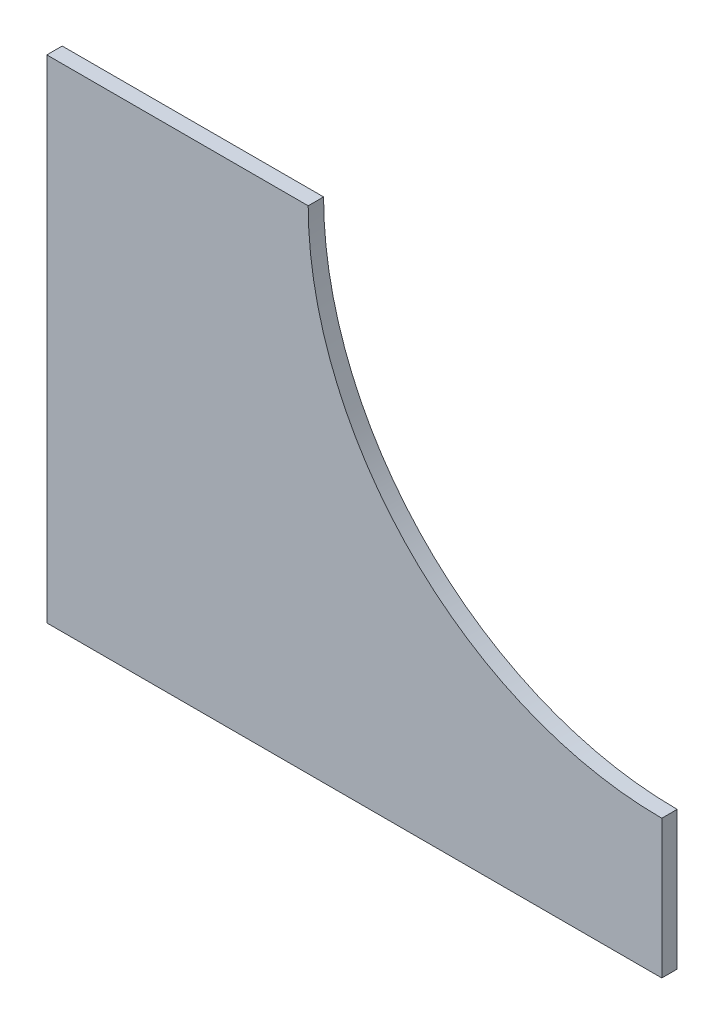
ISO-10303-21;
HEADER;
FILE_DESCRIPTION(('STEP AP214'),'2;1');
FILE_NAME('part.step','',(''),(''),'','','');
FILE_SCHEMA(('AUTOMOTIVE_DESIGN { 1 0 10303 214 1 1 1 1 }'));
ENDSEC;
DATA;
#1=APPLICATION_CONTEXT('core data for automotive mechanical design processes');
#2=APPLICATION_PROTOCOL_DEFINITION('international standard','automotive_design',2000,#1);
#3=PRODUCT_CONTEXT('',#1,'mechanical');
#4=PRODUCT('Part','Part','',(#3));
#5=PRODUCT_RELATED_PRODUCT_CATEGORY('part','',(#4));
#6=PRODUCT_DEFINITION_FORMATION('','',#4);
#7=PRODUCT_DEFINITION_CONTEXT('part definition',#1,'design');
#8=PRODUCT_DEFINITION('design','',#6,#7);
#9=PRODUCT_DEFINITION_SHAPE('','',#8);
#10=(LENGTH_UNIT() NAMED_UNIT(*) SI_UNIT(.MILLI.,.METRE.));
#11=(NAMED_UNIT(*) PLANE_ANGLE_UNIT() SI_UNIT($,.RADIAN.));
#12=(NAMED_UNIT(*) SI_UNIT($,.STERADIAN.) SOLID_ANGLE_UNIT());
#13=UNCERTAINTY_MEASURE_WITH_UNIT(LENGTH_MEASURE(1.E-05),#10,'distance_accuracy_value','');
#14=(GEOMETRIC_REPRESENTATION_CONTEXT(3) GLOBAL_UNCERTAINTY_ASSIGNED_CONTEXT((#13)) GLOBAL_UNIT_ASSIGNED_CONTEXT((#10,
#11,#12)) REPRESENTATION_CONTEXT('',''));
#15=CARTESIAN_POINT('',(0.,0.,0.));
#16=DIRECTION('',(0.,0.,1.));
#17=DIRECTION('',(1.,0.,0.));
#18=AXIS2_PLACEMENT_3D('',#15,#16,#17);
#19=CARTESIAN_POINT('',(98.4294784744164,-123.629958099048,3.175));
#20=DIRECTION('',(0.,0.,-1.));
#21=DIRECTION('',(-1.,0.,0.));
#22=AXIS2_PLACEMENT_3D('',#19,#20,#21);
#23=CYLINDRICAL_SURFACE('',#22,73.0250000000014);
#24=CARTESIAN_POINT('',(98.4294784744164,-123.629958099048,0.));
#25=DIRECTION('',(0.,0.,-1.));
#26=DIRECTION('',(-1.,0.,0.));
#27=AXIS2_PLACEMENT_3D('',#24,#25,#26);
#28=CIRCLE('',#27,73.0250000000014);
#29=CARTESIAN_POINT('',(98.4294784744164,-196.654958099049,0.));
#30=VERTEX_POINT('',#29);
#31=CARTESIAN_POINT('',(25.404478474415,-123.62995809905,0.));
#32=VERTEX_POINT('',#31);
#33=EDGE_CURVE('E110',#30,#32,#28,.T.);
#34=ORIENTED_EDGE('',*,*,#33,.T.);
#35=DIRECTION('',(0.,0.,-1.));
#36=VECTOR('',#35,1.);
#37=CARTESIAN_POINT('',(25.404478474415,-123.62995809905,3.175));
#38=LINE('',#37,#36);
#39=CARTESIAN_POINT('',(25.404478474415,-123.62995809905,3.175));
#40=VERTEX_POINT('',#39);
#41=EDGE_CURVE('E11',#40,#32,#38,.T.);
#42=ORIENTED_EDGE('',*,*,#41,.F.);
#43=CARTESIAN_POINT('',(98.4294784744164,-123.629958099048,3.175));
#44=DIRECTION('',(0.,0.,-1.));
#45=DIRECTION('',(-1.,0.,0.));
#46=AXIS2_PLACEMENT_3D('',#43,#44,#45);
#47=CIRCLE('',#46,73.0250000000014);
#48=CARTESIAN_POINT('',(98.4294784744164,-196.654958099049,3.175));
#49=VERTEX_POINT('',#48);
#50=EDGE_CURVE('E118',#49,#40,#47,.T.);
#51=ORIENTED_EDGE('',*,*,#50,.F.);
#52=DIRECTION('',(0.,0.,-1.));
#53=VECTOR('',#52,1.);
#54=CARTESIAN_POINT('',(98.4294784744164,-196.654958099049,3.175));
#55=LINE('',#54,#53);
#56=EDGE_CURVE('E106',#49,#30,#55,.T.);
#57=ORIENTED_EDGE('',*,*,#56,.T.);
#58=EDGE_LOOP('',(#34,#42,#51,#57));
#59=FACE_BOUND('',#58,.T.);
#60=ADVANCED_FACE('F36',(#59),#23,.F.);
#61=CARTESIAN_POINT('',(-28.570521525585,-123.62995809905,3.175));
#62=DIRECTION('',(0.,-1.,0.));
#63=DIRECTION('',(1.,0.,0.));
#64=AXIS2_PLACEMENT_3D('',#61,#62,#63);
#65=PLANE('',#64);
#66=DIRECTION('',(-1.,0.,0.));
#67=VECTOR('',#66,1.);
#68=CARTESIAN_POINT('',(-28.570521525585,-123.62995809905,0.));
#69=LINE('',#68,#67);
#70=CARTESIAN_POINT('',(-28.570521525585,-123.62995809905,0.));
#71=VERTEX_POINT('',#70);
#72=EDGE_CURVE('E113',#32,#71,#69,.T.);
#73=ORIENTED_EDGE('',*,*,#72,.T.);
#74=DIRECTION('',(0.,0.,-1.));
#75=VECTOR('',#74,1.);
#76=CARTESIAN_POINT('',(-28.570521525585,-123.62995809905,3.175));
#77=LINE('',#76,#75);
#78=CARTESIAN_POINT('',(-28.570521525585,-123.62995809905,3.175));
#79=VERTEX_POINT('',#78);
#80=EDGE_CURVE('E44',#79,#71,#77,.T.);
#81=ORIENTED_EDGE('',*,*,#80,.F.);
#82=DIRECTION('',(-1.,0.,0.));
#83=VECTOR('',#82,1.);
#84=CARTESIAN_POINT('',(-28.570521525585,-123.62995809905,3.175));
#85=LINE('',#84,#83);
#86=EDGE_CURVE('E86',#40,#79,#85,.T.);
#87=ORIENTED_EDGE('',*,*,#86,.F.);
#88=ORIENTED_EDGE('',*,*,#41,.T.);
#89=EDGE_LOOP('',(#73,#81,#87,#88));
#90=FACE_BOUND('',#89,.T.);
#91=ADVANCED_FACE('F137',(#90),#65,.F.);
#92=CARTESIAN_POINT('',(-28.570521525585,-225.22995809905,3.175));
#93=DIRECTION('',(1.,0.,0.));
#94=DIRECTION('',(0.,1.,0.));
#95=AXIS2_PLACEMENT_3D('',#92,#93,#94);
#96=PLANE('',#95);
#97=DIRECTION('',(0.,-1.,0.));
#98=VECTOR('',#97,1.);
#99=CARTESIAN_POINT('',(-28.570521525585,-225.22995809905,0.));
#100=LINE('',#99,#98);
#101=CARTESIAN_POINT('',(-28.570521525585,-225.22995809905,0.));
#102=VERTEX_POINT('',#101);
#103=EDGE_CURVE('E101',#71,#102,#100,.T.);
#104=ORIENTED_EDGE('',*,*,#103,.T.);
#105=DIRECTION('',(0.,0.,-1.));
#106=VECTOR('',#105,1.);
#107=CARTESIAN_POINT('',(-28.570521525585,-225.22995809905,3.175));
#108=LINE('',#107,#106);
#109=CARTESIAN_POINT('',(-28.570521525585,-225.22995809905,3.175));
#110=VERTEX_POINT('',#109);
#111=EDGE_CURVE('E98',#110,#102,#108,.T.);
#112=ORIENTED_EDGE('',*,*,#111,.F.);
#113=DIRECTION('',(0.,-1.,0.));
#114=VECTOR('',#113,1.);
#115=CARTESIAN_POINT('',(-28.570521525585,-225.22995809905,3.175));
#116=LINE('',#115,#114);
#117=EDGE_CURVE('E90',#79,#110,#116,.T.);
#118=ORIENTED_EDGE('',*,*,#117,.F.);
#119=ORIENTED_EDGE('',*,*,#80,.T.);
#120=EDGE_LOOP('',(#104,#112,#118,#119));
#121=FACE_BOUND('',#120,.T.);
#122=ADVANCED_FACE('F99',(#121),#96,.F.);
#123=CARTESIAN_POINT('',(98.4294784744164,-225.22995809905,3.175));
#124=DIRECTION('',(0.,1.,0.));
#125=DIRECTION('',(0.,0.,1.));
#126=AXIS2_PLACEMENT_3D('',#123,#124,#125);
#127=PLANE('',#126);
#128=DIRECTION('',(1.,0.,0.));
#129=VECTOR('',#128,1.);
#130=CARTESIAN_POINT('',(98.4294784744164,-225.22995809905,0.));
#131=LINE('',#130,#129);
#132=CARTESIAN_POINT('',(98.4294784744164,-225.22995809905,0.));
#133=VERTEX_POINT('',#132);
#134=EDGE_CURVE('E72',#102,#133,#131,.T.);
#135=ORIENTED_EDGE('',*,*,#134,.T.);
#136=DIRECTION('',(0.,0.,-1.));
#137=VECTOR('',#136,1.);
#138=CARTESIAN_POINT('',(98.4294784744164,-225.22995809905,3.175));
#139=LINE('',#138,#137);
#140=CARTESIAN_POINT('',(98.4294784744164,-225.22995809905,3.175));
#141=VERTEX_POINT('',#140);
#142=EDGE_CURVE('E102',#141,#133,#139,.T.);
#143=ORIENTED_EDGE('',*,*,#142,.F.);
#144=DIRECTION('',(1.,0.,0.));
#145=VECTOR('',#144,1.);
#146=CARTESIAN_POINT('',(98.4294784744164,-225.22995809905,3.175));
#147=LINE('',#146,#145);
#148=EDGE_CURVE('E94',#110,#141,#147,.T.);
#149=ORIENTED_EDGE('',*,*,#148,.F.);
#150=ORIENTED_EDGE('',*,*,#111,.T.);
#151=EDGE_LOOP('',(#135,#143,#149,#150));
#152=FACE_BOUND('',#151,.T.);
#153=ADVANCED_FACE('F104',(#152),#127,.F.);
#154=CARTESIAN_POINT('',(98.4294784744164,-196.654958099049,3.175));
#155=DIRECTION('',(-1.,0.,0.));
#156=DIRECTION('',(0.,0.,1.));
#157=AXIS2_PLACEMENT_3D('',#154,#155,#156);
#158=PLANE('',#157);
#159=DIRECTION('',(0.,1.,0.));
#160=VECTOR('',#159,1.);
#161=CARTESIAN_POINT('',(98.4294784744164,-196.654958099049,0.));
#162=LINE('',#161,#160);
#163=EDGE_CURVE('E78',#133,#30,#162,.T.);
#164=ORIENTED_EDGE('',*,*,#163,.T.);
#165=ORIENTED_EDGE('',*,*,#56,.F.);
#166=DIRECTION('',(0.,1.,0.));
#167=VECTOR('',#166,1.);
#168=CARTESIAN_POINT('',(98.4294784744164,-196.654958099049,3.175));
#169=LINE('',#168,#167);
#170=EDGE_CURVE('E52',#141,#49,#169,.T.);
#171=ORIENTED_EDGE('',*,*,#170,.F.);
#172=ORIENTED_EDGE('',*,*,#142,.T.);
#173=EDGE_LOOP('',(#164,#165,#171,#172));
#174=FACE_BOUND('',#173,.T.);
#175=ADVANCED_FACE('F126',(#174),#158,.F.);
#176=CARTESIAN_POINT('',(98.4294784744164,-123.629958099048,3.175));
#177=DIRECTION('',(0.,0.,-1.));
#178=DIRECTION('',(-1.,0.,0.));
#179=AXIS2_PLACEMENT_3D('',#176,#177,#178);
#180=PLANE('',#179);
#181=ORIENTED_EDGE('',*,*,#50,.T.);
#182=ORIENTED_EDGE('',*,*,#86,.T.);
#183=ORIENTED_EDGE('',*,*,#117,.T.);
#184=ORIENTED_EDGE('',*,*,#148,.T.);
#185=ORIENTED_EDGE('',*,*,#170,.T.);
#186=EDGE_LOOP('',(#181,#182,#183,#184,#185));
#187=FACE_BOUND('',#186,.T.);
#188=ADVANCED_FACE('F92',(#187),#180,.F.);
#189=CARTESIAN_POINT('',(98.4294784744164,-123.629958099048,0.));
#190=DIRECTION('',(0.,0.,-1.));
#191=DIRECTION('',(-1.,0.,0.));
#192=AXIS2_PLACEMENT_3D('',#189,#190,#191);
#193=PLANE('',#192);
#194=ORIENTED_EDGE('',*,*,#33,.F.);
#195=ORIENTED_EDGE('',*,*,#163,.F.);
#196=ORIENTED_EDGE('',*,*,#134,.F.);
#197=ORIENTED_EDGE('',*,*,#103,.F.);
#198=ORIENTED_EDGE('',*,*,#72,.F.);
#199=EDGE_LOOP('',(#194,#195,#196,#197,#198));
#200=FACE_BOUND('',#199,.T.);
#201=ADVANCED_FACE('F122',(#200),#193,.T.);
#202=CLOSED_SHELL('',(#60,#91,#122,#153,#175,#188,#201));
#203=MANIFOLD_SOLID_BREP('B2',#202);
#204=ADVANCED_BREP_SHAPE_REPRESENTATION('',(#18,#203),#14);
#205=SHAPE_DEFINITION_REPRESENTATION(#9,#204);
ENDSEC;
END-ISO-10303-21;
